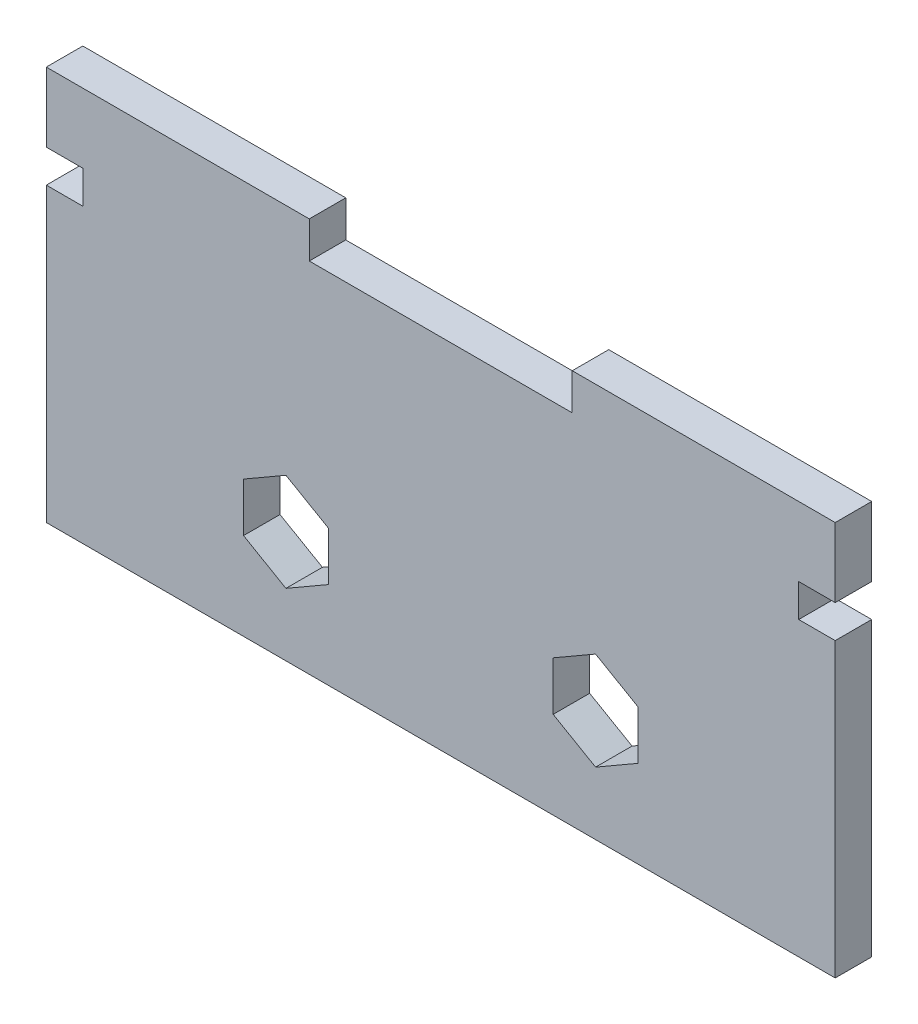
ISO-10303-21;
HEADER;
FILE_DESCRIPTION(('STEP AP214'),'2;1');
FILE_NAME('part.step','',(''),(''),'','','');
FILE_SCHEMA(('AUTOMOTIVE_DESIGN { 1 0 10303 214 1 1 1 1 }'));
ENDSEC;
DATA;
#1=APPLICATION_CONTEXT('core data for automotive mechanical design processes');
#2=APPLICATION_PROTOCOL_DEFINITION('international standard','automotive_design',2000,#1);
#3=PRODUCT_CONTEXT('',#1,'mechanical');
#4=PRODUCT('Part','Part','',(#3));
#5=PRODUCT_RELATED_PRODUCT_CATEGORY('part','',(#4));
#6=PRODUCT_DEFINITION_FORMATION('','',#4);
#7=PRODUCT_DEFINITION_CONTEXT('part definition',#1,'design');
#8=PRODUCT_DEFINITION('design','',#6,#7);
#9=PRODUCT_DEFINITION_SHAPE('','',#8);
#10=(LENGTH_UNIT() NAMED_UNIT(*) SI_UNIT(.MILLI.,.METRE.));
#11=(NAMED_UNIT(*) PLANE_ANGLE_UNIT() SI_UNIT($,.RADIAN.));
#12=(NAMED_UNIT(*) SI_UNIT($,.STERADIAN.) SOLID_ANGLE_UNIT());
#13=UNCERTAINTY_MEASURE_WITH_UNIT(LENGTH_MEASURE(1.E-05),#10,'distance_accuracy_value','');
#14=(GEOMETRIC_REPRESENTATION_CONTEXT(3) GLOBAL_UNCERTAINTY_ASSIGNED_CONTEXT((#13)) GLOBAL_UNIT_ASSIGNED_CONTEXT((#10,
#11,#12)) REPRESENTATION_CONTEXT('',''));
#15=CARTESIAN_POINT('',(0.,0.,0.));
#16=DIRECTION('',(0.,0.,1.));
#17=DIRECTION('',(1.,0.,0.));
#18=AXIS2_PLACEMENT_3D('',#15,#16,#17);
#19=CARTESIAN_POINT('',(0.,0.,0.));
#20=DIRECTION('',(0.,0.,-1.));
#21=DIRECTION('',(-1.,0.,0.));
#22=AXIS2_PLACEMENT_3D('',#19,#20,#21);
#23=PLANE('',#22);
#24=DIRECTION('',(0.,-1.,0.));
#25=VECTOR('',#24,1.);
#26=CARTESIAN_POINT('',(65.278,11.2422705398664,0.));
#27=LINE('',#26,#25);
#28=CARTESIAN_POINT('',(65.278,17.5480901799555,0.));
#29=VERTEX_POINT('',#28);
#30=CARTESIAN_POINT('',(65.278,11.2422705398664,0.));
#31=VERTEX_POINT('',#30);
#32=EDGE_CURVE('E319',#29,#31,#27,.T.);
#33=ORIENTED_EDGE('',*,*,#32,.T.);
#34=DIRECTION('',(0.86602540378444,-0.499999999999998,0.));
#35=VECTOR('',#34,1.);
#36=CARTESIAN_POINT('',(70.739,8.08936071982182,0.));
#37=LINE('',#36,#35);
#38=CARTESIAN_POINT('',(70.739,8.08936071982182,0.));
#39=VERTEX_POINT('',#38);
#40=EDGE_CURVE('E304',#31,#39,#37,.T.);
#41=ORIENTED_EDGE('',*,*,#40,.T.);
#42=DIRECTION('',(0.866025403784436,0.500000000000005,0.));
#43=VECTOR('',#42,1.);
#44=CARTESIAN_POINT('',(76.2,11.2422705398664,0.));
#45=LINE('',#44,#43);
#46=CARTESIAN_POINT('',(76.2,11.2422705398664,0.));
#47=VERTEX_POINT('',#46);
#48=EDGE_CURVE('E307',#39,#47,#45,.T.);
#49=ORIENTED_EDGE('',*,*,#48,.T.);
#50=DIRECTION('',(0.,1.,0.));
#51=VECTOR('',#50,1.);
#52=CARTESIAN_POINT('',(76.2,17.5480901799555,0.));
#53=LINE('',#52,#51);
#54=CARTESIAN_POINT('',(76.2,17.5480901799555,0.));
#55=VERTEX_POINT('',#54);
#56=EDGE_CURVE('E310',#47,#55,#53,.T.);
#57=ORIENTED_EDGE('',*,*,#56,.T.);
#58=DIRECTION('',(-0.86602540378444,0.499999999999998,0.));
#59=VECTOR('',#58,1.);
#60=CARTESIAN_POINT('',(70.739,20.701,0.));
#61=LINE('',#60,#59);
#62=CARTESIAN_POINT('',(70.739,20.701,0.));
#63=VERTEX_POINT('',#62);
#64=EDGE_CURVE('E313',#55,#63,#61,.T.);
#65=ORIENTED_EDGE('',*,*,#64,.T.);
#66=DIRECTION('',(-0.866025403784436,-0.500000000000004,0.));
#67=VECTOR('',#66,1.);
#68=CARTESIAN_POINT('',(65.278,17.5480901799555,0.));
#69=LINE('',#68,#67);
#70=EDGE_CURVE('E316',#63,#29,#69,.T.);
#71=ORIENTED_EDGE('',*,*,#70,.T.);
#72=EDGE_LOOP('',(#33,#41,#49,#57,#65,#71));
#73=FACE_BOUND('',#72,.T.);
#74=DIRECTION('',(-0.866025403784436,0.500000000000004,0.));
#75=VECTOR('',#74,1.);
#76=CARTESIAN_POINT('',(30.861,20.701,0.));
#77=LINE('',#76,#75);
#78=CARTESIAN_POINT('',(36.322,17.5480901799554,0.));
#79=VERTEX_POINT('',#78);
#80=CARTESIAN_POINT('',(30.861,20.701,0.));
#81=VERTEX_POINT('',#80);
#82=EDGE_CURVE('E288',#79,#81,#77,.T.);
#83=ORIENTED_EDGE('',*,*,#82,.T.);
#84=DIRECTION('',(-0.86602540378444,-0.499999999999998,0.));
#85=VECTOR('',#84,1.);
#86=CARTESIAN_POINT('',(25.4,17.5480901799555,0.));
#87=LINE('',#86,#85);
#88=CARTESIAN_POINT('',(25.4,17.5480901799555,0.));
#89=VERTEX_POINT('',#88);
#90=EDGE_CURVE('E273',#81,#89,#87,.T.);
#91=ORIENTED_EDGE('',*,*,#90,.T.);
#92=DIRECTION('',(0.,-1.,0.));
#93=VECTOR('',#92,1.);
#94=CARTESIAN_POINT('',(25.4,11.2422705398664,0.));
#95=LINE('',#94,#93);
#96=CARTESIAN_POINT('',(25.4,11.2422705398664,0.));
#97=VERTEX_POINT('',#96);
#98=EDGE_CURVE('E276',#89,#97,#95,.T.);
#99=ORIENTED_EDGE('',*,*,#98,.T.);
#100=DIRECTION('',(0.866025403784436,-0.500000000000004,0.));
#101=VECTOR('',#100,1.);
#102=CARTESIAN_POINT('',(30.861,8.08936071982182,0.));
#103=LINE('',#102,#101);
#104=CARTESIAN_POINT('',(30.861,8.08936071982182,0.));
#105=VERTEX_POINT('',#104);
#106=EDGE_CURVE('E279',#97,#105,#103,.T.);
#107=ORIENTED_EDGE('',*,*,#106,.T.);
#108=DIRECTION('',(0.86602540378444,0.499999999999998,0.));
#109=VECTOR('',#108,1.);
#110=CARTESIAN_POINT('',(36.322,11.2422705398663,0.));
#111=LINE('',#110,#109);
#112=CARTESIAN_POINT('',(36.322,11.2422705398663,0.));
#113=VERTEX_POINT('',#112);
#114=EDGE_CURVE('E282',#105,#113,#111,.T.);
#115=ORIENTED_EDGE('',*,*,#114,.T.);
#116=DIRECTION('',(0.,1.,0.));
#117=VECTOR('',#116,1.);
#118=CARTESIAN_POINT('',(36.322,17.5480901799554,0.));
#119=LINE('',#118,#117);
#120=EDGE_CURVE('E285',#113,#79,#119,.T.);
#121=ORIENTED_EDGE('',*,*,#120,.T.);
#122=EDGE_LOOP('',(#83,#91,#99,#107,#115,#121));
#123=FACE_BOUND('',#122,.T.);
#124=DIRECTION('',(0.,-1.,0.));
#125=VECTOR('',#124,1.);
#126=CARTESIAN_POINT('',(0.,0.,0.));
#127=LINE('',#126,#125);
#128=CARTESIAN_POINT('',(0.,37.6343333333333,0.));
#129=VERTEX_POINT('',#128);
#130=CARTESIAN_POINT('',(0.,0.,0.));
#131=VERTEX_POINT('',#130);
#132=EDGE_CURVE('E361',#129,#131,#127,.T.);
#133=ORIENTED_EDGE('',*,*,#132,.F.);
#134=DIRECTION('',(-1.,0.,0.));
#135=VECTOR('',#134,1.);
#136=CARTESIAN_POINT('',(4.699,37.6343333333333,0.));
#137=LINE('',#136,#135);
#138=CARTESIAN_POINT('',(4.699,37.6343333333333,0.));
#139=VERTEX_POINT('',#138);
#140=EDGE_CURVE('E228',#139,#129,#137,.T.);
#141=ORIENTED_EDGE('',*,*,#140,.F.);
#142=DIRECTION('',(0.,1.,0.));
#143=VECTOR('',#142,1.);
#144=CARTESIAN_POINT('',(4.699,37.6343333333333,0.));
#145=LINE('',#144,#143);
#146=CARTESIAN_POINT('',(4.699,41.8676666666667,0.));
#147=VERTEX_POINT('',#146);
#148=EDGE_CURVE('E235',#139,#147,#145,.T.);
#149=ORIENTED_EDGE('',*,*,#148,.T.);
#150=DIRECTION('',(-1.,0.,0.));
#151=VECTOR('',#150,1.);
#152=CARTESIAN_POINT('',(4.699,41.8676666666667,0.));
#153=LINE('',#152,#151);
#154=CARTESIAN_POINT('',(0.,41.8676666666667,0.));
#155=VERTEX_POINT('',#154);
#156=EDGE_CURVE('E244',#147,#155,#153,.T.);
#157=ORIENTED_EDGE('',*,*,#156,.T.);
#158=CARTESIAN_POINT('',(0.,50.8,0.));
#159=VERTEX_POINT('',#158);
#160=EDGE_CURVE('E374',#159,#155,#127,.T.);
#161=ORIENTED_EDGE('',*,*,#160,.F.);
#162=DIRECTION('',(-1.,0.,0.));
#163=VECTOR('',#162,1.);
#164=CARTESIAN_POINT('',(0.,50.8,0.));
#165=LINE('',#164,#163);
#166=CARTESIAN_POINT('',(33.8666666666667,50.8,0.));
#167=VERTEX_POINT('',#166);
#168=EDGE_CURVE('E383',#167,#159,#165,.T.);
#169=ORIENTED_EDGE('',*,*,#168,.F.);
#170=DIRECTION('',(0.,-1.,0.));
#171=VECTOR('',#170,1.);
#172=CARTESIAN_POINT('',(33.8666666666667,50.8,0.));
#173=LINE('',#172,#171);
#174=CARTESIAN_POINT('',(33.8666666666667,46.101,0.));
#175=VERTEX_POINT('',#174);
#176=EDGE_CURVE('E349',#167,#175,#173,.T.);
#177=ORIENTED_EDGE('',*,*,#176,.T.);
#178=DIRECTION('',(-1.,0.,0.));
#179=VECTOR('',#178,1.);
#180=CARTESIAN_POINT('',(33.8666666666667,46.101,0.));
#181=LINE('',#180,#179);
#182=CARTESIAN_POINT('',(67.7333333333333,46.101,0.));
#183=VERTEX_POINT('',#182);
#184=EDGE_CURVE('E343',#183,#175,#181,.T.);
#185=ORIENTED_EDGE('',*,*,#184,.F.);
#186=DIRECTION('',(0.,-1.,0.));
#187=VECTOR('',#186,1.);
#188=CARTESIAN_POINT('',(67.7333333333333,50.8,0.));
#189=LINE('',#188,#187);
#190=CARTESIAN_POINT('',(67.7333333333333,50.8,0.));
#191=VERTEX_POINT('',#190);
#192=EDGE_CURVE('E352',#191,#183,#189,.T.);
#193=ORIENTED_EDGE('',*,*,#192,.F.);
#194=CARTESIAN_POINT('',(101.6,50.8,0.));
#195=VERTEX_POINT('',#194);
#196=EDGE_CURVE('E384',#195,#191,#165,.T.);
#197=ORIENTED_EDGE('',*,*,#196,.F.);
#198=DIRECTION('',(0.,1.,0.));
#199=VECTOR('',#198,1.);
#200=CARTESIAN_POINT('',(101.6,0.,0.));
#201=LINE('',#200,#199);
#202=CARTESIAN_POINT('',(101.6,41.8676666666667,0.));
#203=VERTEX_POINT('',#202);
#204=EDGE_CURVE('E379',#203,#195,#201,.T.);
#205=ORIENTED_EDGE('',*,*,#204,.F.);
#206=DIRECTION('',(-1.,0.,0.));
#207=VECTOR('',#206,1.);
#208=CARTESIAN_POINT('',(101.6,41.8676666666667,0.));
#209=LINE('',#208,#207);
#210=CARTESIAN_POINT('',(96.901,41.8676666666667,0.));
#211=VERTEX_POINT('',#210);
#212=EDGE_CURVE('E56',#203,#211,#209,.T.);
#213=ORIENTED_EDGE('',*,*,#212,.T.);
#214=DIRECTION('',(0.,1.,0.));
#215=VECTOR('',#214,1.);
#216=CARTESIAN_POINT('',(96.901,37.6343333333334,0.));
#217=LINE('',#216,#215);
#218=CARTESIAN_POINT('',(96.901,37.6343333333334,0.));
#219=VERTEX_POINT('',#218);
#220=EDGE_CURVE('E261',#219,#211,#217,.T.);
#221=ORIENTED_EDGE('',*,*,#220,.F.);
#222=DIRECTION('',(-1.,0.,0.));
#223=VECTOR('',#222,1.);
#224=CARTESIAN_POINT('',(101.6,37.6343333333334,0.));
#225=LINE('',#224,#223);
#226=CARTESIAN_POINT('',(101.6,37.6343333333334,0.));
#227=VERTEX_POINT('',#226);
#228=EDGE_CURVE('E267',#227,#219,#225,.T.);
#229=ORIENTED_EDGE('',*,*,#228,.F.);
#230=CARTESIAN_POINT('',(101.6,0.,0.));
#231=VERTEX_POINT('',#230);
#232=EDGE_CURVE('E380',#231,#227,#201,.T.);
#233=ORIENTED_EDGE('',*,*,#232,.F.);
#234=DIRECTION('',(1.,0.,0.));
#235=VECTOR('',#234,1.);
#236=CARTESIAN_POINT('',(0.,0.,0.));
#237=LINE('',#236,#235);
#238=EDGE_CURVE('E377',#131,#231,#237,.T.);
#239=ORIENTED_EDGE('',*,*,#238,.F.);
#240=EDGE_LOOP('',(#133,#141,#149,#157,#161,#169,#177,#185,#193,#197,#205,#213,#221,#229,#233,#239));
#241=FACE_BOUND('',#240,.T.);
#242=ADVANCED_FACE('F33',(#73,#123,#241),#23,.T.);
#243=CARTESIAN_POINT('',(0.,0.,4.699));
#244=DIRECTION('',(0.,0.,-1.));
#245=DIRECTION('',(-1.,0.,0.));
#246=AXIS2_PLACEMENT_3D('',#243,#244,#245);
#247=PLANE('',#246);
#248=DIRECTION('',(0.,-1.,0.));
#249=VECTOR('',#248,1.);
#250=CARTESIAN_POINT('',(0.,0.,4.699));
#251=LINE('',#250,#249);
#252=CARTESIAN_POINT('',(0.,50.8,4.699));
#253=VERTEX_POINT('',#252);
#254=CARTESIAN_POINT('',(0.,41.8676666666667,4.699));
#255=VERTEX_POINT('',#254);
#256=EDGE_CURVE('E48',#253,#255,#251,.T.);
#257=ORIENTED_EDGE('',*,*,#256,.T.);
#258=DIRECTION('',(-1.,0.,0.));
#259=VECTOR('',#258,1.);
#260=CARTESIAN_POINT('',(4.699,41.8676666666667,4.699));
#261=LINE('',#260,#259);
#262=CARTESIAN_POINT('',(4.699,41.8676666666667,4.699));
#263=VERTEX_POINT('',#262);
#264=EDGE_CURVE('E241',#263,#255,#261,.T.);
#265=ORIENTED_EDGE('',*,*,#264,.F.);
#266=DIRECTION('',(0.,1.,0.));
#267=VECTOR('',#266,1.);
#268=CARTESIAN_POINT('',(4.699,0.,4.699));
#269=LINE('',#268,#267);
#270=CARTESIAN_POINT('',(4.699,37.6343333333333,4.699));
#271=VERTEX_POINT('',#270);
#272=EDGE_CURVE('E11',#271,#263,#269,.T.);
#273=ORIENTED_EDGE('',*,*,#272,.F.);
#274=DIRECTION('',(-1.,0.,0.));
#275=VECTOR('',#274,1.);
#276=CARTESIAN_POINT('',(4.699,37.6343333333333,4.699));
#277=LINE('',#276,#275);
#278=CARTESIAN_POINT('',(0.,37.6343333333333,4.699));
#279=VERTEX_POINT('',#278);
#280=EDGE_CURVE('E218',#271,#279,#277,.T.);
#281=ORIENTED_EDGE('',*,*,#280,.T.);
#282=CARTESIAN_POINT('',(0.,0.,4.699));
#283=VERTEX_POINT('',#282);
#284=EDGE_CURVE('E364',#279,#283,#251,.T.);
#285=ORIENTED_EDGE('',*,*,#284,.T.);
#286=DIRECTION('',(1.,0.,0.));
#287=VECTOR('',#286,1.);
#288=CARTESIAN_POINT('',(0.,0.,4.699));
#289=LINE('',#288,#287);
#290=CARTESIAN_POINT('',(101.6,0.,4.699));
#291=VERTEX_POINT('',#290);
#292=EDGE_CURVE('E363',#283,#291,#289,.T.);
#293=ORIENTED_EDGE('',*,*,#292,.T.);
#294=DIRECTION('',(0.,1.,0.));
#295=VECTOR('',#294,1.);
#296=CARTESIAN_POINT('',(101.6,0.,4.699));
#297=LINE('',#296,#295);
#298=CARTESIAN_POINT('',(101.6,37.6343333333334,4.69900000000001));
#299=VERTEX_POINT('',#298);
#300=EDGE_CURVE('E367',#291,#299,#297,.T.);
#301=ORIENTED_EDGE('',*,*,#300,.T.);
#302=DIRECTION('',(-1.,0.,0.));
#303=VECTOR('',#302,1.);
#304=CARTESIAN_POINT('',(101.6,37.6343333333334,4.69900000000001));
#305=LINE('',#304,#303);
#306=CARTESIAN_POINT('',(96.901,37.6343333333334,4.69900000000001));
#307=VERTEX_POINT('',#306);
#308=EDGE_CURVE('E270',#299,#307,#305,.T.);
#309=ORIENTED_EDGE('',*,*,#308,.T.);
#310=DIRECTION('',(0.,1.,0.));
#311=VECTOR('',#310,1.);
#312=CARTESIAN_POINT('',(96.901,0.,4.699));
#313=LINE('',#312,#311);
#314=CARTESIAN_POINT('',(96.901,41.8676666666667,4.69900000000001));
#315=VERTEX_POINT('',#314);
#316=EDGE_CURVE('E41',#307,#315,#313,.T.);
#317=ORIENTED_EDGE('',*,*,#316,.T.);
#318=DIRECTION('',(-1.,0.,0.));
#319=VECTOR('',#318,1.);
#320=CARTESIAN_POINT('',(101.6,41.8676666666667,4.69900000000001));
#321=LINE('',#320,#319);
#322=CARTESIAN_POINT('',(101.6,41.8676666666667,4.69900000000001));
#323=VERTEX_POINT('',#322);
#324=EDGE_CURVE('E259',#323,#315,#321,.T.);
#325=ORIENTED_EDGE('',*,*,#324,.F.);
#326=CARTESIAN_POINT('',(101.6,50.8,4.699));
#327=VERTEX_POINT('',#326);
#328=EDGE_CURVE('E366',#323,#327,#297,.T.);
#329=ORIENTED_EDGE('',*,*,#328,.T.);
#330=DIRECTION('',(-1.,0.,0.));
#331=VECTOR('',#330,1.);
#332=CARTESIAN_POINT('',(0.,50.8,4.699));
#333=LINE('',#332,#331);
#334=CARTESIAN_POINT('',(67.7333333333333,50.8,4.69900000000002));
#335=VERTEX_POINT('',#334);
#336=EDGE_CURVE('E370',#327,#335,#333,.T.);
#337=ORIENTED_EDGE('',*,*,#336,.T.);
#338=DIRECTION('',(0.,-1.,0.));
#339=VECTOR('',#338,1.);
#340=CARTESIAN_POINT('',(67.7333333333333,50.8,4.69900000000002));
#341=LINE('',#340,#339);
#342=CARTESIAN_POINT('',(67.7333333333333,46.101,4.69900000000002));
#343=VERTEX_POINT('',#342);
#344=EDGE_CURVE('E355',#335,#343,#341,.T.);
#345=ORIENTED_EDGE('',*,*,#344,.T.);
#346=DIRECTION('',(-1.,0.,0.));
#347=VECTOR('',#346,1.);
#348=CARTESIAN_POINT('',(0.,46.101,4.699));
#349=LINE('',#348,#347);
#350=CARTESIAN_POINT('',(33.8666666666667,46.101,4.69900000000002));
#351=VERTEX_POINT('',#350);
#352=EDGE_CURVE('E358',#343,#351,#349,.T.);
#353=ORIENTED_EDGE('',*,*,#352,.T.);
#354=DIRECTION('',(0.,-1.,0.));
#355=VECTOR('',#354,1.);
#356=CARTESIAN_POINT('',(33.8666666666667,50.8,4.69900000000002));
#357=LINE('',#356,#355);
#358=CARTESIAN_POINT('',(33.8666666666667,50.8,4.69900000000002));
#359=VERTEX_POINT('',#358);
#360=EDGE_CURVE('E341',#359,#351,#357,.T.);
#361=ORIENTED_EDGE('',*,*,#360,.F.);
#362=EDGE_CURVE('E369',#359,#253,#333,.T.);
#363=ORIENTED_EDGE('',*,*,#362,.T.);
#364=EDGE_LOOP('',(#257,#265,#273,#281,#285,#293,#301,#309,#317,#325,#329,#337,#345,#353,#361,#363));
#365=FACE_BOUND('',#364,.T.);
#366=DIRECTION('',(0.86602540378444,-0.499999999999998,0.));
#367=VECTOR('',#366,1.);
#368=CARTESIAN_POINT('',(21.1875459418707,36.69790605902,4.699));
#369=LINE('',#368,#367);
#370=CARTESIAN_POINT('',(65.278,11.2422705398664,4.699));
#371=VERTEX_POINT('',#370);
#372=CARTESIAN_POINT('',(70.739,8.08936071982182,4.699));
#373=VERTEX_POINT('',#372);
#374=EDGE_CURVE('E409',#371,#373,#369,.T.);
#375=ORIENTED_EDGE('',*,*,#374,.F.);
#376=DIRECTION('',(0.,-1.,0.));
#377=VECTOR('',#376,1.);
#378=CARTESIAN_POINT('',(65.278,0.,4.699));
#379=LINE('',#378,#377);
#380=CARTESIAN_POINT('',(65.278,17.5480901799555,4.699));
#381=VERTEX_POINT('',#380);
#382=EDGE_CURVE('E398',#381,#371,#379,.T.);
#383=ORIENTED_EDGE('',*,*,#382,.F.);
#384=DIRECTION('',(-0.866025403784436,-0.500000000000004,0.));
#385=VECTOR('',#384,1.);
#386=CARTESIAN_POINT('',(8.72095405812939,-15.1051355191539,4.699));
#387=LINE('',#386,#385);
#388=CARTESIAN_POINT('',(70.739,20.701,4.699));
#389=VERTEX_POINT('',#388);
#390=EDGE_CURVE('E400',#389,#381,#387,.T.);
#391=ORIENTED_EDGE('',*,*,#390,.F.);
#392=DIRECTION('',(-0.86602540378444,0.499999999999998,0.));
#393=VECTOR('',#392,1.);
#394=CARTESIAN_POINT('',(26.6485459418707,46.1566355191537,4.699));
#395=LINE('',#394,#393);
#396=CARTESIAN_POINT('',(76.2,17.5480901799555,4.699));
#397=VERTEX_POINT('',#396);
#398=EDGE_CURVE('E403',#397,#389,#395,.T.);
#399=ORIENTED_EDGE('',*,*,#398,.F.);
#400=DIRECTION('',(0.,1.,0.));
#401=VECTOR('',#400,1.);
#402=CARTESIAN_POINT('',(76.2,0.,4.699));
#403=LINE('',#402,#401);
#404=CARTESIAN_POINT('',(76.2,11.2422705398664,4.699));
#405=VERTEX_POINT('',#404);
#406=EDGE_CURVE('E405',#405,#397,#403,.T.);
#407=ORIENTED_EDGE('',*,*,#406,.F.);
#408=DIRECTION('',(0.866025403784436,0.500000000000004,0.));
#409=VECTOR('',#408,1.);
#410=CARTESIAN_POINT('',(14.1819540581295,-24.5638649792876,4.699));
#411=LINE('',#410,#409);
#412=EDGE_CURVE('E407',#373,#405,#411,.T.);
#413=ORIENTED_EDGE('',*,*,#412,.F.);
#414=EDGE_LOOP('',(#375,#383,#391,#399,#407,#413));
#415=FACE_BOUND('',#414,.T.);
#416=DIRECTION('',(-0.86602540378444,-0.499999999999998,0.));
#417=VECTOR('',#416,1.);
#418=CARTESIAN_POINT('',(-1.24854594187088,2.16254500690432,4.699));
#419=LINE('',#418,#417);
#420=CARTESIAN_POINT('',(30.861,20.701,4.699));
#421=VERTEX_POINT('',#420);
#422=CARTESIAN_POINT('',(25.4,17.5480901799555,4.699));
#423=VERTEX_POINT('',#422);
#424=EDGE_CURVE('E422',#421,#423,#419,.T.);
#425=ORIENTED_EDGE('',*,*,#424,.F.);
#426=DIRECTION('',(-0.866025403784436,0.500000000000004,0.));
#427=VECTOR('',#426,1.);
#428=CARTESIAN_POINT('',(16.679045941871,28.8889549930958,4.699));
#429=LINE('',#428,#427);
#430=CARTESIAN_POINT('',(36.322,17.5480901799555,4.699));
#431=VERTEX_POINT('',#430);
#432=EDGE_CURVE('E411',#431,#421,#429,.T.);
#433=ORIENTED_EDGE('',*,*,#432,.F.);
#434=DIRECTION('',(0.,1.,0.));
#435=VECTOR('',#434,1.);
#436=CARTESIAN_POINT('',(36.322,0.,4.699));
#437=LINE('',#436,#435);
#438=CARTESIAN_POINT('',(36.322,11.2422705398663,4.699));
#439=VERTEX_POINT('',#438);
#440=EDGE_CURVE('E413',#439,#431,#437,.T.);
#441=ORIENTED_EDGE('',*,*,#440,.F.);
#442=DIRECTION('',(0.86602540378444,0.499999999999998,0.));
#443=VECTOR('',#442,1.);
#444=CARTESIAN_POINT('',(4.2124540581291,-7.29618445322935,4.699));
#445=LINE('',#444,#443);
#446=CARTESIAN_POINT('',(30.861,8.08936071982182,4.699));
#447=VERTEX_POINT('',#446);
#448=EDGE_CURVE('E416',#447,#439,#445,.T.);
#449=ORIENTED_EDGE('',*,*,#448,.F.);
#450=DIRECTION('',(0.866025403784436,-0.500000000000004,0.));
#451=VECTOR('',#450,1.);
#452=CARTESIAN_POINT('',(11.218045941871,19.4302255329622,4.699));
#453=LINE('',#452,#451);
#454=CARTESIAN_POINT('',(25.4,11.2422705398664,4.699));
#455=VERTEX_POINT('',#454);
#456=EDGE_CURVE('E418',#455,#447,#453,.T.);
#457=ORIENTED_EDGE('',*,*,#456,.F.);
#458=DIRECTION('',(0.,-1.,0.));
#459=VECTOR('',#458,1.);
#460=CARTESIAN_POINT('',(25.4,0.,4.699));
#461=LINE('',#460,#459);
#462=EDGE_CURVE('E420',#423,#455,#461,.T.);
#463=ORIENTED_EDGE('',*,*,#462,.F.);
#464=EDGE_LOOP('',(#425,#433,#441,#449,#457,#463));
#465=FACE_BOUND('',#464,.T.);
#466=ADVANCED_FACE('F239',(#365,#415,#465),#247,.F.);
#467=CARTESIAN_POINT('',(0.,0.,4.699));
#468=DIRECTION('',(1.,0.,0.));
#469=DIRECTION('',(0.,0.,-1.));
#470=AXIS2_PLACEMENT_3D('',#467,#468,#469);
#471=PLANE('',#470);
#472=DIRECTION('',(0.,0.,-1.));
#473=VECTOR('',#472,1.);
#474=CARTESIAN_POINT('',(0.,37.6343333333333,4.699));
#475=LINE('',#474,#473);
#476=EDGE_CURVE('E224',#279,#129,#475,.T.);
#477=ORIENTED_EDGE('',*,*,#476,.T.);
#478=ORIENTED_EDGE('',*,*,#132,.T.);
#479=DIRECTION('',(0.,0.,-1.));
#480=VECTOR('',#479,1.);
#481=CARTESIAN_POINT('',(0.,0.,4.699));
#482=LINE('',#481,#480);
#483=EDGE_CURVE('E395',#283,#131,#482,.T.);
#484=ORIENTED_EDGE('',*,*,#483,.F.);
#485=ORIENTED_EDGE('',*,*,#284,.F.);
#486=EDGE_LOOP('',(#477,#478,#484,#485));
#487=FACE_BOUND('',#486,.T.);
#488=ADVANCED_FACE('F35',(#487),#471,.F.);
#489=DIRECTION('',(0.,0.,1.));
#490=VECTOR('',#489,1.);
#491=CARTESIAN_POINT('',(0.,41.8676666666667,4.699));
#492=LINE('',#491,#490);
#493=EDGE_CURVE('E237',#155,#255,#492,.T.);
#494=ORIENTED_EDGE('',*,*,#493,.T.);
#495=ORIENTED_EDGE('',*,*,#256,.F.);
#496=DIRECTION('',(0.,0.,-1.));
#497=VECTOR('',#496,1.);
#498=CARTESIAN_POINT('',(0.,50.8,4.699));
#499=LINE('',#498,#497);
#500=EDGE_CURVE('E373',#253,#159,#499,.T.);
#501=ORIENTED_EDGE('',*,*,#500,.T.);
#502=ORIENTED_EDGE('',*,*,#160,.T.);
#503=EDGE_LOOP('',(#494,#495,#501,#502));
#504=FACE_BOUND('',#503,.T.);
#505=ADVANCED_FACE('F466',(#504),#471,.F.);
#506=CARTESIAN_POINT('',(101.6,0.,4.699));
#507=DIRECTION('',(-1.,0.,0.));
#508=DIRECTION('',(0.,0.,1.));
#509=AXIS2_PLACEMENT_3D('',#506,#507,#508);
#510=PLANE('',#509);
#511=DIRECTION('',(0.,0.,-1.));
#512=VECTOR('',#511,1.);
#513=CARTESIAN_POINT('',(101.6,37.6343333333334,4.69900000000001));
#514=LINE('',#513,#512);
#515=EDGE_CURVE('E254',#299,#227,#514,.T.);
#516=ORIENTED_EDGE('',*,*,#515,.F.);
#517=ORIENTED_EDGE('',*,*,#300,.F.);
#518=DIRECTION('',(0.,0.,-1.));
#519=VECTOR('',#518,1.);
#520=CARTESIAN_POINT('',(101.6,0.,4.699));
#521=LINE('',#520,#519);
#522=EDGE_CURVE('E392',#291,#231,#521,.T.);
#523=ORIENTED_EDGE('',*,*,#522,.T.);
#524=ORIENTED_EDGE('',*,*,#232,.T.);
#525=EDGE_LOOP('',(#516,#517,#523,#524));
#526=FACE_BOUND('',#525,.T.);
#527=ADVANCED_FACE('F477',(#526),#510,.F.);
#528=DIRECTION('',(0.,0.,1.));
#529=VECTOR('',#528,1.);
#530=CARTESIAN_POINT('',(101.6,41.8676666666667,4.69900000000001));
#531=LINE('',#530,#529);
#532=EDGE_CURVE('E256',#203,#323,#531,.T.);
#533=ORIENTED_EDGE('',*,*,#532,.F.);
#534=ORIENTED_EDGE('',*,*,#204,.T.);
#535=DIRECTION('',(0.,0.,-1.));
#536=VECTOR('',#535,1.);
#537=CARTESIAN_POINT('',(101.6,50.8,4.699));
#538=LINE('',#537,#536);
#539=EDGE_CURVE('E389',#327,#195,#538,.T.);
#540=ORIENTED_EDGE('',*,*,#539,.F.);
#541=ORIENTED_EDGE('',*,*,#328,.F.);
#542=EDGE_LOOP('',(#533,#534,#540,#541));
#543=FACE_BOUND('',#542,.T.);
#544=ADVANCED_FACE('F441',(#543),#510,.F.);
#545=CARTESIAN_POINT('',(0.,50.8,4.699));
#546=DIRECTION('',(0.,-1.,0.));
#547=DIRECTION('',(0.,0.,-1.));
#548=AXIS2_PLACEMENT_3D('',#545,#546,#547);
#549=PLANE('',#548);
#550=DIRECTION('',(0.,0.,-1.));
#551=VECTOR('',#550,1.);
#552=CARTESIAN_POINT('',(67.7333333333333,50.8,4.69900000000002));
#553=LINE('',#552,#551);
#554=EDGE_CURVE('E336',#335,#191,#553,.T.);
#555=ORIENTED_EDGE('',*,*,#554,.F.);
#556=ORIENTED_EDGE('',*,*,#336,.F.);
#557=ORIENTED_EDGE('',*,*,#539,.T.);
#558=ORIENTED_EDGE('',*,*,#196,.T.);
#559=EDGE_LOOP('',(#555,#556,#557,#558));
#560=FACE_BOUND('',#559,.T.);
#561=ADVANCED_FACE('F448',(#560),#549,.F.);
#562=DIRECTION('',(0.,0.,1.));
#563=VECTOR('',#562,1.);
#564=CARTESIAN_POINT('',(33.8666666666667,50.8,4.69900000000002));
#565=LINE('',#564,#563);
#566=EDGE_CURVE('E338',#167,#359,#565,.T.);
#567=ORIENTED_EDGE('',*,*,#566,.F.);
#568=ORIENTED_EDGE('',*,*,#168,.T.);
#569=ORIENTED_EDGE('',*,*,#500,.F.);
#570=ORIENTED_EDGE('',*,*,#362,.F.);
#571=EDGE_LOOP('',(#567,#568,#569,#570));
#572=FACE_BOUND('',#571,.T.);
#573=ADVANCED_FACE('F462',(#572),#549,.F.);
#574=CARTESIAN_POINT('',(0.,0.,4.699));
#575=DIRECTION('',(0.,1.,0.));
#576=DIRECTION('',(0.,0.,1.));
#577=AXIS2_PLACEMENT_3D('',#574,#575,#576);
#578=PLANE('',#577);
#579=ORIENTED_EDGE('',*,*,#238,.T.);
#580=ORIENTED_EDGE('',*,*,#522,.F.);
#581=ORIENTED_EDGE('',*,*,#292,.F.);
#582=ORIENTED_EDGE('',*,*,#483,.T.);
#583=EDGE_LOOP('',(#579,#580,#581,#582));
#584=FACE_BOUND('',#583,.T.);
#585=ADVANCED_FACE('F473',(#584),#578,.F.);
#586=CARTESIAN_POINT('',(0.,46.101,36.449));
#587=DIRECTION('',(0.,-1.,0.));
#588=DIRECTION('',(-1.,0.,0.));
#589=AXIS2_PLACEMENT_3D('',#586,#587,#588);
#590=PLANE('',#589);
#591=DIRECTION('',(0.,0.,-1.));
#592=VECTOR('',#591,1.);
#593=CARTESIAN_POINT('',(67.7333333333333,46.101,4.69900000000002));
#594=LINE('',#593,#592);
#595=EDGE_CURVE('E335',#343,#183,#594,.T.);
#596=ORIENTED_EDGE('',*,*,#595,.T.);
#597=ORIENTED_EDGE('',*,*,#184,.T.);
#598=DIRECTION('',(0.,0.,1.));
#599=VECTOR('',#598,1.);
#600=CARTESIAN_POINT('',(33.8666666666667,46.101,4.69900000000002));
#601=LINE('',#600,#599);
#602=EDGE_CURVE('E339',#175,#351,#601,.T.);
#603=ORIENTED_EDGE('',*,*,#602,.T.);
#604=ORIENTED_EDGE('',*,*,#352,.F.);
#605=EDGE_LOOP('',(#596,#597,#603,#604));
#606=FACE_BOUND('',#605,.T.);
#607=ADVANCED_FACE('F455',(#606),#590,.F.);
#608=CARTESIAN_POINT('',(67.7333333333333,50.8,4.69900000000002));
#609=DIRECTION('',(-1.,0.,0.));
#610=DIRECTION('',(0.,1.,0.));
#611=AXIS2_PLACEMENT_3D('',#608,#609,#610);
#612=PLANE('',#611);
#613=ORIENTED_EDGE('',*,*,#595,.F.);
#614=ORIENTED_EDGE('',*,*,#344,.F.);
#615=ORIENTED_EDGE('',*,*,#554,.T.);
#616=ORIENTED_EDGE('',*,*,#192,.T.);
#617=EDGE_LOOP('',(#613,#614,#615,#616));
#618=FACE_BOUND('',#617,.T.);
#619=ADVANCED_FACE('F453',(#618),#612,.T.);
#620=CARTESIAN_POINT('',(33.8666666666667,50.8,4.69900000000002));
#621=DIRECTION('',(1.,0.,0.));
#622=DIRECTION('',(0.,-1.,0.));
#623=AXIS2_PLACEMENT_3D('',#620,#621,#622);
#624=PLANE('',#623);
#625=ORIENTED_EDGE('',*,*,#602,.F.);
#626=ORIENTED_EDGE('',*,*,#176,.F.);
#627=ORIENTED_EDGE('',*,*,#566,.T.);
#628=ORIENTED_EDGE('',*,*,#360,.T.);
#629=EDGE_LOOP('',(#625,#626,#627,#628));
#630=FACE_BOUND('',#629,.T.);
#631=ADVANCED_FACE('F457',(#630),#624,.T.);
#632=CARTESIAN_POINT('',(70.739,8.08936071982182,12.7));
#633=DIRECTION('',(0.499999999999998,0.86602540378444,0.));
#634=DIRECTION('',(-0.86602540378444,0.499999999999998,0.));
#635=AXIS2_PLACEMENT_3D('',#632,#633,#634);
#636=PLANE('',#635);
#637=ORIENTED_EDGE('',*,*,#374,.T.);
#638=DIRECTION('',(0.,0.,-1.));
#639=VECTOR('',#638,1.);
#640=CARTESIAN_POINT('',(70.739,8.08936071982182,12.7));
#641=LINE('',#640,#639);
#642=EDGE_CURVE('E333',#373,#39,#641,.T.);
#643=ORIENTED_EDGE('',*,*,#642,.T.);
#644=ORIENTED_EDGE('',*,*,#40,.F.);
#645=DIRECTION('',(0.,0.,-1.));
#646=VECTOR('',#645,1.);
#647=CARTESIAN_POINT('',(65.278,11.2422705398664,12.7));
#648=LINE('',#647,#646);
#649=EDGE_CURVE('E322',#371,#31,#648,.T.);
#650=ORIENTED_EDGE('',*,*,#649,.F.);
#651=EDGE_LOOP('',(#637,#643,#644,#650));
#652=FACE_BOUND('',#651,.T.);
#653=ADVANCED_FACE('F511',(#652),#636,.T.);
#654=CARTESIAN_POINT('',(76.2,11.2422705398664,12.7));
#655=DIRECTION('',(-0.500000000000004,0.866025403784436,0.));
#656=DIRECTION('',(-0.866025403784436,-0.500000000000004,0.));
#657=AXIS2_PLACEMENT_3D('',#654,#655,#656);
#658=PLANE('',#657);
#659=ORIENTED_EDGE('',*,*,#412,.T.);
#660=DIRECTION('',(0.,0.,-1.));
#661=VECTOR('',#660,1.);
#662=CARTESIAN_POINT('',(76.2,11.2422705398664,12.7));
#663=LINE('',#662,#661);
#664=EDGE_CURVE('E331',#405,#47,#663,.T.);
#665=ORIENTED_EDGE('',*,*,#664,.T.);
#666=ORIENTED_EDGE('',*,*,#48,.F.);
#667=ORIENTED_EDGE('',*,*,#642,.F.);
#668=EDGE_LOOP('',(#659,#665,#666,#667));
#669=FACE_BOUND('',#668,.T.);
#670=ADVANCED_FACE('F517',(#669),#658,.T.);
#671=CARTESIAN_POINT('',(76.2,17.5480901799555,12.7));
#672=DIRECTION('',(-1.,0.,0.));
#673=DIRECTION('',(0.,0.,1.));
#674=AXIS2_PLACEMENT_3D('',#671,#672,#673);
#675=PLANE('',#674);
#676=ORIENTED_EDGE('',*,*,#406,.T.);
#677=DIRECTION('',(0.,0.,-1.));
#678=VECTOR('',#677,1.);
#679=CARTESIAN_POINT('',(76.2,17.5480901799555,12.7));
#680=LINE('',#679,#678);
#681=EDGE_CURVE('E329',#397,#55,#680,.T.);
#682=ORIENTED_EDGE('',*,*,#681,.T.);
#683=ORIENTED_EDGE('',*,*,#56,.F.);
#684=ORIENTED_EDGE('',*,*,#664,.F.);
#685=EDGE_LOOP('',(#676,#682,#683,#684));
#686=FACE_BOUND('',#685,.T.);
#687=ADVANCED_FACE('F522',(#686),#675,.T.);
#688=CARTESIAN_POINT('',(70.739,20.701,12.7));
#689=DIRECTION('',(-0.499999999999998,-0.86602540378444,0.));
#690=DIRECTION('',(0.86602540378444,-0.499999999999998,0.));
#691=AXIS2_PLACEMENT_3D('',#688,#689,#690);
#692=PLANE('',#691);
#693=ORIENTED_EDGE('',*,*,#398,.T.);
#694=DIRECTION('',(0.,0.,-1.));
#695=VECTOR('',#694,1.);
#696=CARTESIAN_POINT('',(70.739,20.701,12.7));
#697=LINE('',#696,#695);
#698=EDGE_CURVE('E327',#389,#63,#697,.T.);
#699=ORIENTED_EDGE('',*,*,#698,.T.);
#700=ORIENTED_EDGE('',*,*,#64,.F.);
#701=ORIENTED_EDGE('',*,*,#681,.F.);
#702=EDGE_LOOP('',(#693,#699,#700,#701));
#703=FACE_BOUND('',#702,.T.);
#704=ADVANCED_FACE('F540',(#703),#692,.T.);
#705=CARTESIAN_POINT('',(65.278,17.5480901799555,12.7));
#706=DIRECTION('',(0.500000000000004,-0.866025403784436,0.));
#707=DIRECTION('',(0.866025403784436,0.500000000000004,0.));
#708=AXIS2_PLACEMENT_3D('',#705,#706,#707);
#709=PLANE('',#708);
#710=ORIENTED_EDGE('',*,*,#390,.T.);
#711=DIRECTION('',(0.,0.,-1.));
#712=VECTOR('',#711,1.);
#713=CARTESIAN_POINT('',(65.278,17.5480901799555,12.7));
#714=LINE('',#713,#712);
#715=EDGE_CURVE('E325',#381,#29,#714,.T.);
#716=ORIENTED_EDGE('',*,*,#715,.T.);
#717=ORIENTED_EDGE('',*,*,#70,.F.);
#718=ORIENTED_EDGE('',*,*,#698,.F.);
#719=EDGE_LOOP('',(#710,#716,#717,#718));
#720=FACE_BOUND('',#719,.T.);
#721=ADVANCED_FACE('F547',(#720),#709,.T.);
#722=CARTESIAN_POINT('',(65.278,11.2422705398664,12.7));
#723=DIRECTION('',(1.,0.,0.));
#724=DIRECTION('',(0.,0.,-1.));
#725=AXIS2_PLACEMENT_3D('',#722,#723,#724);
#726=PLANE('',#725);
#727=ORIENTED_EDGE('',*,*,#382,.T.);
#728=ORIENTED_EDGE('',*,*,#649,.T.);
#729=ORIENTED_EDGE('',*,*,#32,.F.);
#730=ORIENTED_EDGE('',*,*,#715,.F.);
#731=EDGE_LOOP('',(#727,#728,#729,#730));
#732=FACE_BOUND('',#731,.T.);
#733=ADVANCED_FACE('F545',(#732),#726,.T.);
#734=CARTESIAN_POINT('',(25.4,17.5480901799555,12.7));
#735=DIRECTION('',(0.499999999999998,-0.86602540378444,0.));
#736=DIRECTION('',(0.86602540378444,0.499999999999998,0.));
#737=AXIS2_PLACEMENT_3D('',#734,#735,#736);
#738=PLANE('',#737);
#739=ORIENTED_EDGE('',*,*,#424,.T.);
#740=DIRECTION('',(0.,0.,-1.));
#741=VECTOR('',#740,1.);
#742=CARTESIAN_POINT('',(25.4,17.5480901799555,12.7));
#743=LINE('',#742,#741);
#744=EDGE_CURVE('E302',#423,#89,#743,.T.);
#745=ORIENTED_EDGE('',*,*,#744,.T.);
#746=ORIENTED_EDGE('',*,*,#90,.F.);
#747=DIRECTION('',(0.,0.,-1.));
#748=VECTOR('',#747,1.);
#749=CARTESIAN_POINT('',(30.861,20.701,12.7));
#750=LINE('',#749,#748);
#751=EDGE_CURVE('E291',#421,#81,#750,.T.);
#752=ORIENTED_EDGE('',*,*,#751,.F.);
#753=EDGE_LOOP('',(#739,#745,#746,#752));
#754=FACE_BOUND('',#753,.T.);
#755=ADVANCED_FACE('F554',(#754),#738,.T.);
#756=CARTESIAN_POINT('',(25.4,11.2422705398664,12.7));
#757=DIRECTION('',(1.,0.,0.));
#758=DIRECTION('',(0.,1.,0.));
#759=AXIS2_PLACEMENT_3D('',#756,#757,#758);
#760=PLANE('',#759);
#761=ORIENTED_EDGE('',*,*,#462,.T.);
#762=DIRECTION('',(0.,0.,-1.));
#763=VECTOR('',#762,1.);
#764=CARTESIAN_POINT('',(25.4,11.2422705398664,12.7));
#765=LINE('',#764,#763);
#766=EDGE_CURVE('E300',#455,#97,#765,.T.);
#767=ORIENTED_EDGE('',*,*,#766,.T.);
#768=ORIENTED_EDGE('',*,*,#98,.F.);
#769=ORIENTED_EDGE('',*,*,#744,.F.);
#770=EDGE_LOOP('',(#761,#767,#768,#769));
#771=FACE_BOUND('',#770,.T.);
#772=ADVANCED_FACE('F587',(#771),#760,.T.);
#773=CARTESIAN_POINT('',(30.861,8.08936071982182,12.7));
#774=DIRECTION('',(0.500000000000004,0.866025403784436,0.));
#775=DIRECTION('',(0.,0.,1.));
#776=AXIS2_PLACEMENT_3D('',#773,#774,#775);
#777=PLANE('',#776);
#778=ORIENTED_EDGE('',*,*,#456,.T.);
#779=DIRECTION('',(0.,0.,-1.));
#780=VECTOR('',#779,1.);
#781=CARTESIAN_POINT('',(30.861,8.08936071982182,12.7));
#782=LINE('',#781,#780);
#783=EDGE_CURVE('E298',#447,#105,#782,.T.);
#784=ORIENTED_EDGE('',*,*,#783,.T.);
#785=ORIENTED_EDGE('',*,*,#106,.F.);
#786=ORIENTED_EDGE('',*,*,#766,.F.);
#787=EDGE_LOOP('',(#778,#784,#785,#786));
#788=FACE_BOUND('',#787,.T.);
#789=ADVANCED_FACE('F596',(#788),#777,.T.);
#790=CARTESIAN_POINT('',(36.322,11.2422705398663,12.7));
#791=DIRECTION('',(-0.499999999999998,0.86602540378444,0.));
#792=DIRECTION('',(-0.86602540378444,-0.499999999999998,0.));
#793=AXIS2_PLACEMENT_3D('',#790,#791,#792);
#794=PLANE('',#793);
#795=ORIENTED_EDGE('',*,*,#448,.T.);
#796=DIRECTION('',(0.,0.,-1.));
#797=VECTOR('',#796,1.);
#798=CARTESIAN_POINT('',(36.322,11.2422705398663,12.7));
#799=LINE('',#798,#797);
#800=EDGE_CURVE('E296',#439,#113,#799,.T.);
#801=ORIENTED_EDGE('',*,*,#800,.T.);
#802=ORIENTED_EDGE('',*,*,#114,.F.);
#803=ORIENTED_EDGE('',*,*,#783,.F.);
#804=EDGE_LOOP('',(#795,#801,#802,#803));
#805=FACE_BOUND('',#804,.T.);
#806=ADVANCED_FACE('F606',(#805),#794,.T.);
#807=CARTESIAN_POINT('',(36.322,17.5480901799554,12.7));
#808=DIRECTION('',(-1.,0.,0.));
#809=DIRECTION('',(0.,-1.,0.));
#810=AXIS2_PLACEMENT_3D('',#807,#808,#809);
#811=PLANE('',#810);
#812=ORIENTED_EDGE('',*,*,#440,.T.);
#813=DIRECTION('',(0.,0.,-1.));
#814=VECTOR('',#813,1.);
#815=CARTESIAN_POINT('',(36.322,17.5480901799554,12.7));
#816=LINE('',#815,#814);
#817=EDGE_CURVE('E294',#431,#79,#816,.T.);
#818=ORIENTED_EDGE('',*,*,#817,.T.);
#819=ORIENTED_EDGE('',*,*,#120,.F.);
#820=ORIENTED_EDGE('',*,*,#800,.F.);
#821=EDGE_LOOP('',(#812,#818,#819,#820));
#822=FACE_BOUND('',#821,.T.);
#823=ADVANCED_FACE('F616',(#822),#811,.T.);
#824=CARTESIAN_POINT('',(30.861,20.701,12.7));
#825=DIRECTION('',(-0.500000000000004,-0.866025403784436,0.));
#826=DIRECTION('',(0.,0.,-1.));
#827=AXIS2_PLACEMENT_3D('',#824,#825,#826);
#828=PLANE('',#827);
#829=ORIENTED_EDGE('',*,*,#432,.T.);
#830=ORIENTED_EDGE('',*,*,#751,.T.);
#831=ORIENTED_EDGE('',*,*,#82,.F.);
#832=ORIENTED_EDGE('',*,*,#817,.F.);
#833=EDGE_LOOP('',(#829,#830,#831,#832));
#834=FACE_BOUND('',#833,.T.);
#835=ADVANCED_FACE('F626',(#834),#828,.T.);
#836=CARTESIAN_POINT('',(96.901,33.401,4.69900000000001));
#837=DIRECTION('',(-1.,0.,0.));
#838=DIRECTION('',(0.,-1.,0.));
#839=AXIS2_PLACEMENT_3D('',#836,#837,#838);
#840=PLANE('',#839);
#841=DIRECTION('',(0.,0.,-1.));
#842=VECTOR('',#841,1.);
#843=CARTESIAN_POINT('',(96.901,37.6343333333334,4.69900000000001));
#844=LINE('',#843,#842);
#845=EDGE_CURVE('E227',#307,#219,#844,.T.);
#846=ORIENTED_EDGE('',*,*,#845,.T.);
#847=ORIENTED_EDGE('',*,*,#220,.T.);
#848=DIRECTION('',(0.,0.,1.));
#849=VECTOR('',#848,1.);
#850=CARTESIAN_POINT('',(96.901,41.8676666666667,4.69900000000001));
#851=LINE('',#850,#849);
#852=EDGE_CURVE('E257',#211,#315,#851,.T.);
#853=ORIENTED_EDGE('',*,*,#852,.T.);
#854=ORIENTED_EDGE('',*,*,#316,.F.);
#855=EDGE_LOOP('',(#846,#847,#853,#854));
#856=FACE_BOUND('',#855,.T.);
#857=ADVANCED_FACE('F429',(#856),#840,.F.);
#858=CARTESIAN_POINT('',(101.6,37.6343333333334,4.69900000000001));
#859=DIRECTION('',(0.,1.,0.));
#860=DIRECTION('',(0.,0.,1.));
#861=AXIS2_PLACEMENT_3D('',#858,#859,#860);
#862=PLANE('',#861);
#863=ORIENTED_EDGE('',*,*,#845,.F.);
#864=ORIENTED_EDGE('',*,*,#308,.F.);
#865=ORIENTED_EDGE('',*,*,#515,.T.);
#866=ORIENTED_EDGE('',*,*,#228,.T.);
#867=EDGE_LOOP('',(#863,#864,#865,#866));
#868=FACE_BOUND('',#867,.T.);
#869=ADVANCED_FACE('F431',(#868),#862,.T.);
#870=CARTESIAN_POINT('',(101.6,41.8676666666667,4.69900000000001));
#871=DIRECTION('',(0.,-1.,0.));
#872=DIRECTION('',(1.,0.,0.));
#873=AXIS2_PLACEMENT_3D('',#870,#871,#872);
#874=PLANE('',#873);
#875=ORIENTED_EDGE('',*,*,#852,.F.);
#876=ORIENTED_EDGE('',*,*,#212,.F.);
#877=ORIENTED_EDGE('',*,*,#532,.T.);
#878=ORIENTED_EDGE('',*,*,#324,.T.);
#879=EDGE_LOOP('',(#875,#876,#877,#878));
#880=FACE_BOUND('',#879,.T.);
#881=ADVANCED_FACE('F439',(#880),#874,.T.);
#882=CARTESIAN_POINT('',(4.699,33.401,4.69899999999999));
#883=DIRECTION('',(-1.,0.,0.));
#884=DIRECTION('',(0.,-1.,0.));
#885=AXIS2_PLACEMENT_3D('',#882,#883,#884);
#886=PLANE('',#885);
#887=ORIENTED_EDGE('',*,*,#272,.T.);
#888=DIRECTION('',(0.,0.,1.));
#889=VECTOR('',#888,1.);
#890=CARTESIAN_POINT('',(4.699,41.8676666666667,4.699));
#891=LINE('',#890,#889);
#892=EDGE_CURVE('E245',#147,#263,#891,.T.);
#893=ORIENTED_EDGE('',*,*,#892,.F.);
#894=ORIENTED_EDGE('',*,*,#148,.F.);
#895=DIRECTION('',(0.,0.,-1.));
#896=VECTOR('',#895,1.);
#897=CARTESIAN_POINT('',(4.699,37.6343333333333,4.699));
#898=LINE('',#897,#896);
#899=EDGE_CURVE('E221',#271,#139,#898,.T.);
#900=ORIENTED_EDGE('',*,*,#899,.F.);
#901=EDGE_LOOP('',(#887,#893,#894,#900));
#902=FACE_BOUND('',#901,.T.);
#903=ADVANCED_FACE('F231',(#902),#886,.T.);
#904=CARTESIAN_POINT('',(4.699,37.6343333333333,4.699));
#905=DIRECTION('',(0.,1.,0.));
#906=DIRECTION('',(0.,0.,1.));
#907=AXIS2_PLACEMENT_3D('',#904,#905,#906);
#908=PLANE('',#907);
#909=ORIENTED_EDGE('',*,*,#476,.F.);
#910=ORIENTED_EDGE('',*,*,#280,.F.);
#911=ORIENTED_EDGE('',*,*,#899,.T.);
#912=ORIENTED_EDGE('',*,*,#140,.T.);
#913=EDGE_LOOP('',(#909,#910,#911,#912));
#914=FACE_BOUND('',#913,.T.);
#915=ADVANCED_FACE('F220',(#914),#908,.T.);
#916=CARTESIAN_POINT('',(4.699,41.8676666666667,4.699));
#917=DIRECTION('',(0.,-1.,0.));
#918=DIRECTION('',(1.,0.,0.));
#919=AXIS2_PLACEMENT_3D('',#916,#917,#918);
#920=PLANE('',#919);
#921=ORIENTED_EDGE('',*,*,#493,.F.);
#922=ORIENTED_EDGE('',*,*,#156,.F.);
#923=ORIENTED_EDGE('',*,*,#892,.T.);
#924=ORIENTED_EDGE('',*,*,#264,.T.);
#925=EDGE_LOOP('',(#921,#922,#923,#924));
#926=FACE_BOUND('',#925,.T.);
#927=ADVANCED_FACE('F705',(#926),#920,.T.);
#928=CLOSED_SHELL('',(#242,#466,#488,#505,#527,#544,#561,#573,#585,#607,#619,#631,#653,#670,
#687,#704,#721,#733,#755,#772,#789,#806,#823,#835,#857,#869,#881,#903,#915,#927));
#929=MANIFOLD_SOLID_BREP('B2',#928);
#930=ADVANCED_BREP_SHAPE_REPRESENTATION('',(#18,#929),#14);
#931=SHAPE_DEFINITION_REPRESENTATION(#9,#930);
ENDSEC;
END-ISO-10303-21;
